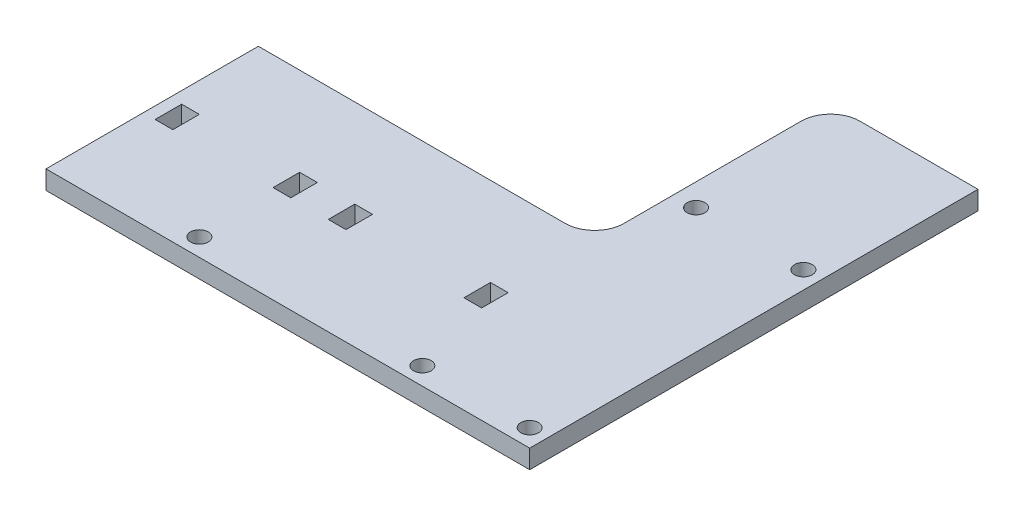
ISO-10303-21;
HEADER;
FILE_DESCRIPTION(('STEP AP214'),'2;1');
FILE_NAME('part.step','',(''),(''),'','','');
FILE_SCHEMA(('AUTOMOTIVE_DESIGN { 1 0 10303 214 1 1 1 1 }'));
ENDSEC;
DATA;
#1=APPLICATION_CONTEXT('core data for automotive mechanical design processes');
#2=APPLICATION_PROTOCOL_DEFINITION('international standard','automotive_design',2000,#1);
#3=PRODUCT_CONTEXT('',#1,'mechanical');
#4=PRODUCT('Part','Part','',(#3));
#5=PRODUCT_RELATED_PRODUCT_CATEGORY('part','',(#4));
#6=PRODUCT_DEFINITION_FORMATION('','',#4);
#7=PRODUCT_DEFINITION_CONTEXT('part definition',#1,'design');
#8=PRODUCT_DEFINITION('design','',#6,#7);
#9=PRODUCT_DEFINITION_SHAPE('','',#8);
#10=(LENGTH_UNIT() NAMED_UNIT(*) SI_UNIT(.MILLI.,.METRE.));
#11=(NAMED_UNIT(*) PLANE_ANGLE_UNIT() SI_UNIT($,.RADIAN.));
#12=(NAMED_UNIT(*) SI_UNIT($,.STERADIAN.) SOLID_ANGLE_UNIT());
#13=UNCERTAINTY_MEASURE_WITH_UNIT(LENGTH_MEASURE(1.E-05),#10,'distance_accuracy_value','');
#14=(GEOMETRIC_REPRESENTATION_CONTEXT(3) GLOBAL_UNCERTAINTY_ASSIGNED_CONTEXT((#13)) GLOBAL_UNIT_ASSIGNED_CONTEXT((#10,
#11,#12)) REPRESENTATION_CONTEXT('',''));
#15=CARTESIAN_POINT('',(0.,0.,0.));
#16=DIRECTION('',(0.,0.,1.));
#17=DIRECTION('',(1.,0.,0.));
#18=AXIS2_PLACEMENT_3D('',#15,#16,#17);
#19=CARTESIAN_POINT('',(57.,3.175,0.));
#20=DIRECTION('',(-1.,0.,0.));
#21=DIRECTION('',(0.,0.,1.));
#22=AXIS2_PLACEMENT_3D('',#19,#20,#21);
#23=PLANE('',#22);
#24=DIRECTION('',(0.,0.,-1.));
#25=VECTOR('',#24,1.);
#26=CARTESIAN_POINT('',(57.,3.175,0.));
#27=LINE('',#26,#25);
#28=CARTESIAN_POINT('',(57.,3.175,-5.));
#29=VERTEX_POINT('',#28);
#30=CARTESIAN_POINT('',(57.,3.175,-35.));
#31=VERTEX_POINT('',#30);
#32=EDGE_CURVE('E418',#29,#31,#27,.T.);
#33=ORIENTED_EDGE('',*,*,#32,.T.);
#34=DIRECTION('',(0.,-1.,0.));
#35=VECTOR('',#34,1.);
#36=CARTESIAN_POINT('',(57.,0.,-35.));
#37=LINE('',#36,#35);
#38=CARTESIAN_POINT('',(57.,0.,-35.));
#39=VERTEX_POINT('',#38);
#40=EDGE_CURVE('E472',#31,#39,#37,.T.);
#41=ORIENTED_EDGE('',*,*,#40,.T.);
#42=DIRECTION('',(0.,0.,-1.));
#43=VECTOR('',#42,1.);
#44=CARTESIAN_POINT('',(57.,0.,0.));
#45=LINE('',#44,#43);
#46=CARTESIAN_POINT('',(57.,0.,-5.));
#47=VERTEX_POINT('',#46);
#48=EDGE_CURVE('E417',#47,#39,#45,.T.);
#49=ORIENTED_EDGE('',*,*,#48,.F.);
#50=DIRECTION('',(0.,-1.,0.));
#51=VECTOR('',#50,1.);
#52=CARTESIAN_POINT('',(57.,3.175,-5.));
#53=LINE('',#52,#51);
#54=EDGE_CURVE('E470',#47,#29,#53,.F.);
#55=ORIENTED_EDGE('',*,*,#54,.T.);
#56=EDGE_LOOP('',(#33,#41,#49,#55));
#57=FACE_BOUND('',#56,.T.);
#58=ADVANCED_FACE('F39',(#57),#23,.T.);
#59=CARTESIAN_POINT('',(0.,3.175,0.));
#60=DIRECTION('',(0.,0.,-1.));
#61=DIRECTION('',(-1.,0.,0.));
#62=AXIS2_PLACEMENT_3D('',#59,#60,#61);
#63=PLANE('',#62);
#64=DIRECTION('',(1.,0.,0.));
#65=VECTOR('',#64,1.);
#66=CARTESIAN_POINT('',(0.,3.175,0.));
#67=LINE('',#66,#65);
#68=CARTESIAN_POINT('',(0.,3.175,0.));
#69=VERTEX_POINT('',#68);
#70=CARTESIAN_POINT('',(52.,3.175,0.));
#71=VERTEX_POINT('',#70);
#72=EDGE_CURVE('E423',#69,#71,#67,.T.);
#73=ORIENTED_EDGE('',*,*,#72,.T.);
#74=DIRECTION('',(0.,-1.,0.));
#75=VECTOR('',#74,1.);
#76=CARTESIAN_POINT('',(52.,0.,0.));
#77=LINE('',#76,#75);
#78=CARTESIAN_POINT('',(52.,0.,0.));
#79=VERTEX_POINT('',#78);
#80=EDGE_CURVE('E481',#71,#79,#77,.T.);
#81=ORIENTED_EDGE('',*,*,#80,.T.);
#82=DIRECTION('',(1.,0.,0.));
#83=VECTOR('',#82,1.);
#84=CARTESIAN_POINT('',(0.,0.,0.));
#85=LINE('',#84,#83);
#86=CARTESIAN_POINT('',(0.,0.,0.));
#87=VERTEX_POINT('',#86);
#88=EDGE_CURVE('E450',#87,#79,#85,.T.);
#89=ORIENTED_EDGE('',*,*,#88,.F.);
#90=DIRECTION('',(0.,-1.,0.));
#91=VECTOR('',#90,1.);
#92=CARTESIAN_POINT('',(0.,3.175,0.));
#93=LINE('',#92,#91);
#94=EDGE_CURVE('E468',#69,#87,#93,.T.);
#95=ORIENTED_EDGE('',*,*,#94,.F.);
#96=EDGE_LOOP('',(#73,#81,#89,#95));
#97=FACE_BOUND('',#96,.T.);
#98=ADVANCED_FACE('F493',(#97),#63,.T.);
#99=CARTESIAN_POINT('',(0.,3.175,0.));
#100=DIRECTION('',(1.,0.,0.));
#101=DIRECTION('',(0.,0.,-1.));
#102=AXIS2_PLACEMENT_3D('',#99,#100,#101);
#103=PLANE('',#102);
#104=DIRECTION('',(0.,0.,1.));
#105=VECTOR('',#104,1.);
#106=CARTESIAN_POINT('',(0.,0.,0.));
#107=LINE('',#106,#105);
#108=CARTESIAN_POINT('',(0.,0.,36.));
#109=VERTEX_POINT('',#108);
#110=EDGE_CURVE('E453',#87,#109,#107,.T.);
#111=ORIENTED_EDGE('',*,*,#110,.T.);
#112=DIRECTION('',(0.,-1.,0.));
#113=VECTOR('',#112,1.);
#114=CARTESIAN_POINT('',(0.,3.175,36.));
#115=LINE('',#114,#113);
#116=CARTESIAN_POINT('',(0.,3.175,36.));
#117=VERTEX_POINT('',#116);
#118=EDGE_CURVE('E465',#117,#109,#115,.T.);
#119=ORIENTED_EDGE('',*,*,#118,.F.);
#120=DIRECTION('',(0.,0.,1.));
#121=VECTOR('',#120,1.);
#122=CARTESIAN_POINT('',(0.,3.175,0.));
#123=LINE('',#122,#121);
#124=EDGE_CURVE('E433',#69,#117,#123,.T.);
#125=ORIENTED_EDGE('',*,*,#124,.F.);
#126=ORIENTED_EDGE('',*,*,#94,.T.);
#127=EDGE_LOOP('',(#111,#119,#125,#126));
#128=FACE_BOUND('',#127,.T.);
#129=ADVANCED_FACE('F551',(#128),#103,.F.);
#130=CARTESIAN_POINT('',(0.,3.175,36.));
#131=DIRECTION('',(0.,0.,-1.));
#132=DIRECTION('',(-1.,0.,0.));
#133=AXIS2_PLACEMENT_3D('',#130,#131,#132);
#134=PLANE('',#133);
#135=DIRECTION('',(1.,0.,0.));
#136=VECTOR('',#135,1.);
#137=CARTESIAN_POINT('',(0.,0.,36.));
#138=LINE('',#137,#136);
#139=CARTESIAN_POINT('',(82.,0.,36.));
#140=VERTEX_POINT('',#139);
#141=EDGE_CURVE('E455',#109,#140,#138,.T.);
#142=ORIENTED_EDGE('',*,*,#141,.T.);
#143=DIRECTION('',(0.,-1.,0.));
#144=VECTOR('',#143,1.);
#145=CARTESIAN_POINT('',(82.,3.175,36.));
#146=LINE('',#145,#144);
#147=CARTESIAN_POINT('',(82.,3.175,36.));
#148=VERTEX_POINT('',#147);
#149=EDGE_CURVE('E462',#148,#140,#146,.T.);
#150=ORIENTED_EDGE('',*,*,#149,.F.);
#151=DIRECTION('',(1.,0.,0.));
#152=VECTOR('',#151,1.);
#153=CARTESIAN_POINT('',(0.,3.175,36.));
#154=LINE('',#153,#152);
#155=EDGE_CURVE('E436',#117,#148,#154,.T.);
#156=ORIENTED_EDGE('',*,*,#155,.F.);
#157=ORIENTED_EDGE('',*,*,#118,.T.);
#158=EDGE_LOOP('',(#142,#150,#156,#157));
#159=FACE_BOUND('',#158,.T.);
#160=ADVANCED_FACE('F573',(#159),#134,.F.);
#161=CARTESIAN_POINT('',(82.,3.175,0.));
#162=DIRECTION('',(-1.,0.,0.));
#163=DIRECTION('',(0.,0.,1.));
#164=AXIS2_PLACEMENT_3D('',#161,#162,#163);
#165=PLANE('',#164);
#166=DIRECTION('',(0.,0.,-1.));
#167=VECTOR('',#166,1.);
#168=CARTESIAN_POINT('',(82.,0.,0.));
#169=LINE('',#168,#167);
#170=CARTESIAN_POINT('',(82.,0.,-40.));
#171=VERTEX_POINT('',#170);
#172=EDGE_CURVE('E457',#140,#171,#169,.T.);
#173=ORIENTED_EDGE('',*,*,#172,.T.);
#174=DIRECTION('',(0.,-1.,0.));
#175=VECTOR('',#174,1.);
#176=CARTESIAN_POINT('',(82.,3.175,-40.));
#177=LINE('',#176,#175);
#178=CARTESIAN_POINT('',(82.,3.175,-40.));
#179=VERTEX_POINT('',#178);
#180=EDGE_CURVE('E447',#179,#171,#177,.T.);
#181=ORIENTED_EDGE('',*,*,#180,.F.);
#182=DIRECTION('',(0.,0.,-1.));
#183=VECTOR('',#182,1.);
#184=CARTESIAN_POINT('',(82.,3.175,0.));
#185=LINE('',#184,#183);
#186=EDGE_CURVE('E439',#148,#179,#185,.T.);
#187=ORIENTED_EDGE('',*,*,#186,.F.);
#188=ORIENTED_EDGE('',*,*,#149,.T.);
#189=EDGE_LOOP('',(#173,#181,#187,#188));
#190=FACE_BOUND('',#189,.T.);
#191=ADVANCED_FACE('F569',(#190),#165,.F.);
#192=CARTESIAN_POINT('',(0.,3.175,-40.));
#193=DIRECTION('',(0.,0.,1.));
#194=DIRECTION('',(1.,0.,0.));
#195=AXIS2_PLACEMENT_3D('',#192,#193,#194);
#196=PLANE('',#195);
#197=DIRECTION('',(-1.,0.,0.));
#198=VECTOR('',#197,1.);
#199=CARTESIAN_POINT('',(0.,0.,-40.));
#200=LINE('',#199,#198);
#201=CARTESIAN_POINT('',(62.,0.,-40.));
#202=VERTEX_POINT('',#201);
#203=EDGE_CURVE('E424',#171,#202,#200,.T.);
#204=ORIENTED_EDGE('',*,*,#203,.T.);
#205=DIRECTION('',(0.,-1.,0.));
#206=VECTOR('',#205,1.);
#207=CARTESIAN_POINT('',(62.,3.175,-40.));
#208=LINE('',#207,#206);
#209=CARTESIAN_POINT('',(62.,3.175,-40.));
#210=VERTEX_POINT('',#209);
#211=EDGE_CURVE('E61',#202,#210,#208,.F.);
#212=ORIENTED_EDGE('',*,*,#211,.T.);
#213=DIRECTION('',(-1.,0.,0.));
#214=VECTOR('',#213,1.);
#215=CARTESIAN_POINT('',(0.,3.175,-40.));
#216=LINE('',#215,#214);
#217=EDGE_CURVE('E443',#179,#210,#216,.T.);
#218=ORIENTED_EDGE('',*,*,#217,.F.);
#219=ORIENTED_EDGE('',*,*,#180,.T.);
#220=EDGE_LOOP('',(#204,#212,#218,#219));
#221=FACE_BOUND('',#220,.T.);
#222=ADVANCED_FACE('F564',(#221),#196,.F.);
#223=CARTESIAN_POINT('',(0.,3.175,0.));
#224=DIRECTION('',(0.,1.,0.));
#225=DIRECTION('',(0.,0.,1.));
#226=AXIS2_PLACEMENT_3D('',#223,#224,#225);
#227=PLANE('',#226);
#228=DIRECTION('',(0.,0.,-1.));
#229=VECTOR('',#228,1.);
#230=CARTESIAN_POINT('',(25.,3.175,19.5000000000002));
#231=LINE('',#230,#229);
#232=CARTESIAN_POINT('',(25.,3.175,19.5000000000002));
#233=VERTEX_POINT('',#232);
#234=CARTESIAN_POINT('',(25.,3.175,15.0000000000002));
#235=VERTEX_POINT('',#234);
#236=EDGE_CURVE('E346',#233,#235,#231,.T.);
#237=ORIENTED_EDGE('',*,*,#236,.F.);
#238=DIRECTION('',(1.,0.,0.));
#239=VECTOR('',#238,1.);
#240=CARTESIAN_POINT('',(25.,3.175,19.5000000000002));
#241=LINE('',#240,#239);
#242=CARTESIAN_POINT('',(22.,3.175,19.5000000000002));
#243=VERTEX_POINT('',#242);
#244=EDGE_CURVE('E355',#243,#233,#241,.T.);
#245=ORIENTED_EDGE('',*,*,#244,.F.);
#246=DIRECTION('',(0.,0.,1.));
#247=VECTOR('',#246,1.);
#248=CARTESIAN_POINT('',(22.,3.175,19.5000000000002));
#249=LINE('',#248,#247);
#250=CARTESIAN_POINT('',(22.,3.175,15.0000000000002));
#251=VERTEX_POINT('',#250);
#252=EDGE_CURVE('E361',#251,#243,#249,.T.);
#253=ORIENTED_EDGE('',*,*,#252,.F.);
#254=DIRECTION('',(-1.,0.,0.));
#255=VECTOR('',#254,1.);
#256=CARTESIAN_POINT('',(25.,3.175,15.0000000000002));
#257=LINE('',#256,#255);
#258=EDGE_CURVE('E349',#235,#251,#257,.T.);
#259=ORIENTED_EDGE('',*,*,#258,.F.);
#260=EDGE_LOOP('',(#237,#245,#253,#259));
#261=FACE_BOUND('',#260,.T.);
#262=DIRECTION('',(0.,0.,-1.));
#263=VECTOR('',#262,1.);
#264=CARTESIAN_POINT('',(5.,3.175,19.5000000000002));
#265=LINE('',#264,#263);
#266=CARTESIAN_POINT('',(5.,3.175,19.5000000000002));
#267=VERTEX_POINT('',#266);
#268=CARTESIAN_POINT('',(5.,3.175,15.0000000000002));
#269=VERTEX_POINT('',#268);
#270=EDGE_CURVE('E308',#267,#269,#265,.T.);
#271=ORIENTED_EDGE('',*,*,#270,.F.);
#272=DIRECTION('',(1.,0.,0.));
#273=VECTOR('',#272,1.);
#274=CARTESIAN_POINT('',(5.,3.175,19.5000000000002));
#275=LINE('',#274,#273);
#276=CARTESIAN_POINT('',(2.,3.175,19.5000000000002));
#277=VERTEX_POINT('',#276);
#278=EDGE_CURVE('E320',#277,#267,#275,.T.);
#279=ORIENTED_EDGE('',*,*,#278,.F.);
#280=DIRECTION('',(0.,0.,1.));
#281=VECTOR('',#280,1.);
#282=CARTESIAN_POINT('',(2.,3.175,19.5000000000002));
#283=LINE('',#282,#281);
#284=CARTESIAN_POINT('',(2.,3.175,15.0000000000002));
#285=VERTEX_POINT('',#284);
#286=EDGE_CURVE('E326',#285,#277,#283,.T.);
#287=ORIENTED_EDGE('',*,*,#286,.F.);
#288=DIRECTION('',(-1.,0.,0.));
#289=VECTOR('',#288,1.);
#290=CARTESIAN_POINT('',(5.,3.175,15.0000000000002));
#291=LINE('',#290,#289);
#292=EDGE_CURVE('E311',#269,#285,#291,.T.);
#293=ORIENTED_EDGE('',*,*,#292,.F.);
#294=EDGE_LOOP('',(#271,#279,#287,#293));
#295=FACE_BOUND('',#294,.T.);
#296=DIRECTION('',(0.,0.,1.));
#297=VECTOR('',#296,1.);
#298=CARTESIAN_POINT('',(31.35,3.175,15.0000000000002));
#299=LINE('',#298,#297);
#300=CARTESIAN_POINT('',(31.35,3.175,15.0000000000002));
#301=VERTEX_POINT('',#300);
#302=CARTESIAN_POINT('',(31.35,3.175,19.5000000000002));
#303=VERTEX_POINT('',#302);
#304=EDGE_CURVE('E268',#301,#303,#299,.T.);
#305=ORIENTED_EDGE('',*,*,#304,.F.);
#306=DIRECTION('',(-1.,0.,0.));
#307=VECTOR('',#306,1.);
#308=CARTESIAN_POINT('',(31.35,3.175,15.0000000000002));
#309=LINE('',#308,#307);
#310=CARTESIAN_POINT('',(34.35,3.175,15.0000000000002));
#311=VERTEX_POINT('',#310);
#312=EDGE_CURVE('E280',#311,#301,#309,.T.);
#313=ORIENTED_EDGE('',*,*,#312,.F.);
#314=DIRECTION('',(0.,0.,-1.));
#315=VECTOR('',#314,1.);
#316=CARTESIAN_POINT('',(34.35,3.175,15.0000000000002));
#317=LINE('',#316,#315);
#318=CARTESIAN_POINT('',(34.35,3.175,19.5000000000002));
#319=VERTEX_POINT('',#318);
#320=EDGE_CURVE('E286',#319,#311,#317,.T.);
#321=ORIENTED_EDGE('',*,*,#320,.F.);
#322=DIRECTION('',(1.,0.,0.));
#323=VECTOR('',#322,1.);
#324=CARTESIAN_POINT('',(31.35,3.175,19.5000000000002));
#325=LINE('',#324,#323);
#326=EDGE_CURVE('E271',#303,#319,#325,.T.);
#327=ORIENTED_EDGE('',*,*,#326,.F.);
#328=EDGE_LOOP('',(#305,#313,#321,#327));
#329=FACE_BOUND('',#328,.T.);
#330=DIRECTION('',(0.,0.,1.));
#331=VECTOR('',#330,1.);
#332=CARTESIAN_POINT('',(54.35,3.175,15.));
#333=LINE('',#332,#331);
#334=CARTESIAN_POINT('',(54.35,3.175,15.));
#335=VERTEX_POINT('',#334);
#336=CARTESIAN_POINT('',(54.35,3.175,19.5));
#337=VERTEX_POINT('',#336);
#338=EDGE_CURVE('E210',#335,#337,#333,.T.);
#339=ORIENTED_EDGE('',*,*,#338,.F.);
#340=DIRECTION('',(-1.,0.,0.));
#341=VECTOR('',#340,1.);
#342=CARTESIAN_POINT('',(54.35,3.175,15.));
#343=LINE('',#342,#341);
#344=CARTESIAN_POINT('',(57.35,3.175,15.));
#345=VERTEX_POINT('',#344);
#346=EDGE_CURVE('E215',#345,#335,#343,.T.);
#347=ORIENTED_EDGE('',*,*,#346,.F.);
#348=DIRECTION('',(0.,0.,-1.));
#349=VECTOR('',#348,1.);
#350=CARTESIAN_POINT('',(57.35,3.175,15.));
#351=LINE('',#350,#349);
#352=CARTESIAN_POINT('',(57.35,3.175,19.5));
#353=VERTEX_POINT('',#352);
#354=EDGE_CURVE('E253',#353,#345,#351,.T.);
#355=ORIENTED_EDGE('',*,*,#354,.F.);
#356=DIRECTION('',(1.,0.,0.));
#357=VECTOR('',#356,1.);
#358=CARTESIAN_POINT('',(54.35,3.175,19.5));
#359=LINE('',#358,#357);
#360=EDGE_CURVE('E232',#337,#353,#359,.T.);
#361=ORIENTED_EDGE('',*,*,#360,.F.);
#362=EDGE_LOOP('',(#339,#347,#355,#361));
#363=FACE_BOUND('',#362,.T.);
#364=CARTESIAN_POINT('',(60.8,3.175,33.0000000000001));
#365=DIRECTION('',(0.,1.,0.));
#366=DIRECTION('',(0.,0.,1.));
#367=AXIS2_PLACEMENT_3D('',#364,#365,#366);
#368=CIRCLE('',#367,1.5);
#369=CARTESIAN_POINT('',(60.8,3.175,34.5000000000001));
#370=VERTEX_POINT('',#369);
#371=EDGE_CURVE('E395',#370,#370,#368,.T.);
#372=ORIENTED_EDGE('',*,*,#371,.F.);
#373=EDGE_LOOP('',(#372));
#374=FACE_BOUND('',#373,.T.);
#375=CARTESIAN_POINT('',(60.7999999999998,3.175,-13.3999999999999));
#376=DIRECTION('',(0.,1.,0.));
#377=DIRECTION('',(0.,0.,1.));
#378=AXIS2_PLACEMENT_3D('',#375,#376,#377);
#379=CIRCLE('',#378,1.5);
#380=CARTESIAN_POINT('',(60.7999999999998,3.175,-11.8999999999999));
#381=VERTEX_POINT('',#380);
#382=EDGE_CURVE('E404',#381,#381,#379,.T.);
#383=ORIENTED_EDGE('',*,*,#382,.F.);
#384=EDGE_LOOP('',(#383));
#385=FACE_BOUND('',#384,.T.);
#386=CARTESIAN_POINT('',(78.9999999999998,3.175,-13.4));
#387=DIRECTION('',(0.,1.,0.));
#388=DIRECTION('',(0.,0.,1.));
#389=AXIS2_PLACEMENT_3D('',#386,#387,#388);
#390=CIRCLE('',#389,1.5);
#391=CARTESIAN_POINT('',(78.9999999999998,3.175,-11.9));
#392=VERTEX_POINT('',#391);
#393=EDGE_CURVE('E373',#392,#392,#390,.T.);
#394=ORIENTED_EDGE('',*,*,#393,.F.);
#395=EDGE_LOOP('',(#394));
#396=FACE_BOUND('',#395,.T.);
#397=CARTESIAN_POINT('',(23.,3.175,33.0000000000001));
#398=DIRECTION('',(0.,1.,0.));
#399=DIRECTION('',(0.,0.,1.));
#400=AXIS2_PLACEMENT_3D('',#397,#398,#399);
#401=CIRCLE('',#400,1.5);
#402=CARTESIAN_POINT('',(23.,3.175,34.5000000000001));
#403=VERTEX_POINT('',#402);
#404=EDGE_CURVE('E223',#403,#403,#401,.T.);
#405=ORIENTED_EDGE('',*,*,#404,.F.);
#406=EDGE_LOOP('',(#405));
#407=FACE_BOUND('',#406,.T.);
#408=CARTESIAN_POINT('',(79.,3.175,33.));
#409=DIRECTION('',(0.,1.,0.));
#410=DIRECTION('',(0.,0.,1.));
#411=AXIS2_PLACEMENT_3D('',#408,#409,#410);
#412=CIRCLE('',#411,1.5);
#413=CARTESIAN_POINT('',(79.,3.175,34.5));
#414=VERTEX_POINT('',#413);
#415=EDGE_CURVE('E403',#414,#414,#412,.T.);
#416=ORIENTED_EDGE('',*,*,#415,.F.);
#417=EDGE_LOOP('',(#416));
#418=FACE_BOUND('',#417,.T.);
#419=ORIENTED_EDGE('',*,*,#217,.T.);
#420=CARTESIAN_POINT('',(62.,3.175,-35.));
#421=DIRECTION('',(0.,1.,0.));
#422=DIRECTION('',(0.,0.,1.));
#423=AXIS2_PLACEMENT_3D('',#420,#421,#422);
#424=CIRCLE('',#423,5.);
#425=EDGE_CURVE('E477',#210,#31,#424,.T.);
#426=ORIENTED_EDGE('',*,*,#425,.T.);
#427=ORIENTED_EDGE('',*,*,#32,.F.);
#428=CARTESIAN_POINT('',(52.,3.175,-5.));
#429=DIRECTION('',(0.,1.,0.));
#430=DIRECTION('',(0.,0.,1.));
#431=AXIS2_PLACEMENT_3D('',#428,#429,#430);
#432=CIRCLE('',#431,5.);
#433=EDGE_CURVE('E12',#29,#71,#432,.F.);
#434=ORIENTED_EDGE('',*,*,#433,.T.);
#435=ORIENTED_EDGE('',*,*,#72,.F.);
#436=ORIENTED_EDGE('',*,*,#124,.T.);
#437=ORIENTED_EDGE('',*,*,#155,.T.);
#438=ORIENTED_EDGE('',*,*,#186,.T.);
#439=EDGE_LOOP('',(#419,#426,#427,#434,#435,#436,#437,#438));
#440=FACE_BOUND('',#439,.T.);
#441=ADVANCED_FACE('F519',(#261,#295,#329,#363,#374,#385,#396,#407,#418,#440),#227,.T.);
#442=CARTESIAN_POINT('',(0.,0.,0.));
#443=DIRECTION('',(0.,1.,0.));
#444=DIRECTION('',(0.,0.,1.));
#445=AXIS2_PLACEMENT_3D('',#442,#443,#444);
#446=PLANE('',#445);
#447=DIRECTION('',(-1.,0.,0.));
#448=VECTOR('',#447,1.);
#449=CARTESIAN_POINT('',(25.,0.,19.5000000000002));
#450=LINE('',#449,#448);
#451=CARTESIAN_POINT('',(25.,0.,19.5000000000002));
#452=VERTEX_POINT('',#451);
#453=CARTESIAN_POINT('',(22.,0.,19.5000000000002));
#454=VERTEX_POINT('',#453);
#455=EDGE_CURVE('E340',#452,#454,#450,.T.);
#456=ORIENTED_EDGE('',*,*,#455,.F.);
#457=DIRECTION('',(0.,0.,1.));
#458=VECTOR('',#457,1.);
#459=CARTESIAN_POINT('',(25.,0.,19.5000000000002));
#460=LINE('',#459,#458);
#461=CARTESIAN_POINT('',(25.,0.,15.0000000000002));
#462=VERTEX_POINT('',#461);
#463=EDGE_CURVE('E343',#462,#452,#460,.T.);
#464=ORIENTED_EDGE('',*,*,#463,.F.);
#465=DIRECTION('',(1.,0.,0.));
#466=VECTOR('',#465,1.);
#467=CARTESIAN_POINT('',(25.,0.,15.0000000000002));
#468=LINE('',#467,#466);
#469=CARTESIAN_POINT('',(22.,0.,15.0000000000002));
#470=VERTEX_POINT('',#469);
#471=EDGE_CURVE('E302',#470,#462,#468,.T.);
#472=ORIENTED_EDGE('',*,*,#471,.F.);
#473=DIRECTION('',(0.,0.,-1.));
#474=VECTOR('',#473,1.);
#475=CARTESIAN_POINT('',(22.,0.,19.5000000000002));
#476=LINE('',#475,#474);
#477=EDGE_CURVE('E338',#454,#470,#476,.T.);
#478=ORIENTED_EDGE('',*,*,#477,.F.);
#479=EDGE_LOOP('',(#456,#464,#472,#478));
#480=FACE_BOUND('',#479,.T.);
#481=DIRECTION('',(-1.,0.,0.));
#482=VECTOR('',#481,1.);
#483=CARTESIAN_POINT('',(5.,0.,19.5000000000002));
#484=LINE('',#483,#482);
#485=CARTESIAN_POINT('',(5.,0.,19.5000000000002));
#486=VERTEX_POINT('',#485);
#487=CARTESIAN_POINT('',(2.,0.,19.5000000000002));
#488=VERTEX_POINT('',#487);
#489=EDGE_CURVE('E301',#486,#488,#484,.T.);
#490=ORIENTED_EDGE('',*,*,#489,.F.);
#491=DIRECTION('',(0.,0.,1.));
#492=VECTOR('',#491,1.);
#493=CARTESIAN_POINT('',(5.,0.,19.5000000000002));
#494=LINE('',#493,#492);
#495=CARTESIAN_POINT('',(5.,0.,15.0000000000002));
#496=VERTEX_POINT('',#495);
#497=EDGE_CURVE('E305',#496,#486,#494,.T.);
#498=ORIENTED_EDGE('',*,*,#497,.F.);
#499=DIRECTION('',(1.,0.,0.));
#500=VECTOR('',#499,1.);
#501=CARTESIAN_POINT('',(5.,0.,15.0000000000002));
#502=LINE('',#501,#500);
#503=CARTESIAN_POINT('',(2.,0.,15.0000000000002));
#504=VERTEX_POINT('',#503);
#505=EDGE_CURVE('E262',#504,#496,#502,.T.);
#506=ORIENTED_EDGE('',*,*,#505,.F.);
#507=DIRECTION('',(0.,0.,-1.));
#508=VECTOR('',#507,1.);
#509=CARTESIAN_POINT('',(2.,0.,19.5000000000002));
#510=LINE('',#509,#508);
#511=EDGE_CURVE('E299',#488,#504,#510,.T.);
#512=ORIENTED_EDGE('',*,*,#511,.F.);
#513=EDGE_LOOP('',(#490,#498,#506,#512));
#514=FACE_BOUND('',#513,.T.);
#515=DIRECTION('',(1.,0.,0.));
#516=VECTOR('',#515,1.);
#517=CARTESIAN_POINT('',(31.35,0.,15.0000000000002));
#518=LINE('',#517,#516);
#519=CARTESIAN_POINT('',(31.35,0.,15.0000000000002));
#520=VERTEX_POINT('',#519);
#521=CARTESIAN_POINT('',(34.35,0.,15.0000000000002));
#522=VERTEX_POINT('',#521);
#523=EDGE_CURVE('E261',#520,#522,#518,.T.);
#524=ORIENTED_EDGE('',*,*,#523,.F.);
#525=DIRECTION('',(0.,0.,-1.));
#526=VECTOR('',#525,1.);
#527=CARTESIAN_POINT('',(31.35,0.,15.0000000000002));
#528=LINE('',#527,#526);
#529=CARTESIAN_POINT('',(31.35,0.,19.5000000000002));
#530=VERTEX_POINT('',#529);
#531=EDGE_CURVE('E265',#530,#520,#528,.T.);
#532=ORIENTED_EDGE('',*,*,#531,.F.);
#533=DIRECTION('',(-1.,0.,0.));
#534=VECTOR('',#533,1.);
#535=CARTESIAN_POINT('',(31.35,0.,19.5000000000002));
#536=LINE('',#535,#534);
#537=CARTESIAN_POINT('',(34.35,0.,19.5000000000002));
#538=VERTEX_POINT('',#537);
#539=EDGE_CURVE('E290',#538,#530,#536,.T.);
#540=ORIENTED_EDGE('',*,*,#539,.F.);
#541=DIRECTION('',(0.,0.,1.));
#542=VECTOR('',#541,1.);
#543=CARTESIAN_POINT('',(34.35,0.,15.0000000000002));
#544=LINE('',#543,#542);
#545=EDGE_CURVE('E259',#522,#538,#544,.T.);
#546=ORIENTED_EDGE('',*,*,#545,.F.);
#547=EDGE_LOOP('',(#524,#532,#540,#546));
#548=FACE_BOUND('',#547,.T.);
#549=DIRECTION('',(1.,0.,0.));
#550=VECTOR('',#549,1.);
#551=CARTESIAN_POINT('',(54.35,0.,15.));
#552=LINE('',#551,#550);
#553=CARTESIAN_POINT('',(54.35,0.,15.));
#554=VERTEX_POINT('',#553);
#555=CARTESIAN_POINT('',(57.35,0.,15.));
#556=VERTEX_POINT('',#555);
#557=EDGE_CURVE('E229',#554,#556,#552,.T.);
#558=ORIENTED_EDGE('',*,*,#557,.F.);
#559=DIRECTION('',(0.,0.,-1.));
#560=VECTOR('',#559,1.);
#561=CARTESIAN_POINT('',(54.35,0.,15.));
#562=LINE('',#561,#560);
#563=CARTESIAN_POINT('',(54.35,0.,19.5));
#564=VERTEX_POINT('',#563);
#565=EDGE_CURVE('E207',#564,#554,#562,.T.);
#566=ORIENTED_EDGE('',*,*,#565,.F.);
#567=DIRECTION('',(-1.,0.,0.));
#568=VECTOR('',#567,1.);
#569=CARTESIAN_POINT('',(54.35,0.,19.5));
#570=LINE('',#569,#568);
#571=CARTESIAN_POINT('',(57.35,0.,19.5));
#572=VERTEX_POINT('',#571);
#573=EDGE_CURVE('E219',#572,#564,#570,.T.);
#574=ORIENTED_EDGE('',*,*,#573,.F.);
#575=DIRECTION('',(0.,0.,1.));
#576=VECTOR('',#575,1.);
#577=CARTESIAN_POINT('',(57.35,0.,15.));
#578=LINE('',#577,#576);
#579=EDGE_CURVE('E234',#556,#572,#578,.T.);
#580=ORIENTED_EDGE('',*,*,#579,.F.);
#581=EDGE_LOOP('',(#558,#566,#574,#580));
#582=FACE_BOUND('',#581,.T.);
#583=CARTESIAN_POINT('',(60.8,0.,33.0000000000001));
#584=DIRECTION('',(0.,1.,0.));
#585=DIRECTION('',(0.,0.,1.));
#586=AXIS2_PLACEMENT_3D('',#583,#584,#585);
#587=CIRCLE('',#586,1.5);
#588=CARTESIAN_POINT('',(60.8,0.,34.5000000000001));
#589=VERTEX_POINT('',#588);
#590=EDGE_CURVE('E400',#589,#589,#587,.F.);
#591=ORIENTED_EDGE('',*,*,#590,.F.);
#592=EDGE_LOOP('',(#591));
#593=FACE_BOUND('',#592,.T.);
#594=CARTESIAN_POINT('',(60.7999999999998,0.,-13.3999999999999));
#595=DIRECTION('',(0.,1.,0.));
#596=DIRECTION('',(0.,0.,1.));
#597=AXIS2_PLACEMENT_3D('',#594,#595,#596);
#598=CIRCLE('',#597,1.5);
#599=CARTESIAN_POINT('',(60.7999999999998,0.,-11.8999999999999));
#600=VERTEX_POINT('',#599);
#601=EDGE_CURVE('E401',#600,#600,#598,.F.);
#602=ORIENTED_EDGE('',*,*,#601,.F.);
#603=EDGE_LOOP('',(#602));
#604=FACE_BOUND('',#603,.T.);
#605=CARTESIAN_POINT('',(78.9999999999998,0.,-13.4));
#606=DIRECTION('',(0.,1.,0.));
#607=DIRECTION('',(0.,0.,1.));
#608=AXIS2_PLACEMENT_3D('',#605,#606,#607);
#609=CIRCLE('',#608,1.5);
#610=CARTESIAN_POINT('',(78.9999999999998,0.,-11.9));
#611=VERTEX_POINT('',#610);
#612=EDGE_CURVE('E378',#611,#611,#609,.F.);
#613=ORIENTED_EDGE('',*,*,#612,.F.);
#614=EDGE_LOOP('',(#613));
#615=FACE_BOUND('',#614,.T.);
#616=CARTESIAN_POINT('',(23.,0.,33.0000000000001));
#617=DIRECTION('',(0.,1.,0.));
#618=DIRECTION('',(0.,0.,1.));
#619=AXIS2_PLACEMENT_3D('',#616,#617,#618);
#620=CIRCLE('',#619,1.5);
#621=CARTESIAN_POINT('',(23.,0.,34.5000000000001));
#622=VERTEX_POINT('',#621);
#623=EDGE_CURVE('E379',#622,#622,#620,.F.);
#624=ORIENTED_EDGE('',*,*,#623,.F.);
#625=EDGE_LOOP('',(#624));
#626=FACE_BOUND('',#625,.T.);
#627=CARTESIAN_POINT('',(79.,0.,33.));
#628=DIRECTION('',(0.,1.,0.));
#629=DIRECTION('',(0.,0.,1.));
#630=AXIS2_PLACEMENT_3D('',#627,#628,#629);
#631=CIRCLE('',#630,1.5);
#632=CARTESIAN_POINT('',(79.,0.,34.5));
#633=VERTEX_POINT('',#632);
#634=EDGE_CURVE('E414',#633,#633,#631,.F.);
#635=ORIENTED_EDGE('',*,*,#634,.F.);
#636=EDGE_LOOP('',(#635));
#637=FACE_BOUND('',#636,.T.);
#638=ORIENTED_EDGE('',*,*,#48,.T.);
#639=CARTESIAN_POINT('',(62.,0.,-35.));
#640=DIRECTION('',(0.,1.,0.));
#641=DIRECTION('',(0.,0.,1.));
#642=AXIS2_PLACEMENT_3D('',#639,#640,#641);
#643=CIRCLE('',#642,5.);
#644=EDGE_CURVE('E475',#39,#202,#643,.F.);
#645=ORIENTED_EDGE('',*,*,#644,.T.);
#646=ORIENTED_EDGE('',*,*,#203,.F.);
#647=ORIENTED_EDGE('',*,*,#172,.F.);
#648=ORIENTED_EDGE('',*,*,#141,.F.);
#649=ORIENTED_EDGE('',*,*,#110,.F.);
#650=ORIENTED_EDGE('',*,*,#88,.T.);
#651=CARTESIAN_POINT('',(52.,0.,-5.));
#652=DIRECTION('',(0.,1.,0.));
#653=DIRECTION('',(0.,0.,1.));
#654=AXIS2_PLACEMENT_3D('',#651,#652,#653);
#655=CIRCLE('',#654,5.);
#656=EDGE_CURVE('E48',#79,#47,#655,.T.);
#657=ORIENTED_EDGE('',*,*,#656,.T.);
#658=EDGE_LOOP('',(#638,#645,#646,#647,#648,#649,#650,#657));
#659=FACE_BOUND('',#658,.T.);
#660=ADVANCED_FACE('F226',(#480,#514,#548,#582,#593,#604,#615,#626,#637,#659),#446,.F.);
#661=CARTESIAN_POINT('',(79.,-0.00100000000000013,33.));
#662=DIRECTION('',(0.,1.,0.));
#663=DIRECTION('',(0.,0.,1.));
#664=AXIS2_PLACEMENT_3D('',#661,#662,#663);
#665=CYLINDRICAL_SURFACE('',#664,1.5);
#666=ORIENTED_EDGE('',*,*,#415,.T.);
#667=EDGE_LOOP('',(#666));
#668=FACE_BOUND('',#667,.T.);
#669=ORIENTED_EDGE('',*,*,#634,.T.);
#670=EDGE_LOOP('',(#669));
#671=FACE_BOUND('',#670,.T.);
#672=ADVANCED_FACE('F588',(#668,#671),#665,.F.);
#673=CARTESIAN_POINT('',(23.,-0.00100000000000013,33.0000000000001));
#674=DIRECTION('',(0.,1.,0.));
#675=DIRECTION('',(0.,0.,1.));
#676=AXIS2_PLACEMENT_3D('',#673,#674,#675);
#677=CYLINDRICAL_SURFACE('',#676,1.5);
#678=ORIENTED_EDGE('',*,*,#404,.T.);
#679=EDGE_LOOP('',(#678));
#680=FACE_BOUND('',#679,.T.);
#681=ORIENTED_EDGE('',*,*,#623,.T.);
#682=EDGE_LOOP('',(#681));
#683=FACE_BOUND('',#682,.T.);
#684=ADVANCED_FACE('F593',(#680,#683),#677,.F.);
#685=CARTESIAN_POINT('',(78.9999999999998,-0.00100000000000013,-13.4));
#686=DIRECTION('',(0.,1.,0.));
#687=DIRECTION('',(0.,0.,1.));
#688=AXIS2_PLACEMENT_3D('',#685,#686,#687);
#689=CYLINDRICAL_SURFACE('',#688,1.5);
#690=ORIENTED_EDGE('',*,*,#393,.T.);
#691=EDGE_LOOP('',(#690));
#692=FACE_BOUND('',#691,.T.);
#693=ORIENTED_EDGE('',*,*,#612,.T.);
#694=EDGE_LOOP('',(#693));
#695=FACE_BOUND('',#694,.T.);
#696=ADVANCED_FACE('F599',(#692,#695),#689,.F.);
#697=CARTESIAN_POINT('',(60.7999999999998,-0.00100000000000013,-13.3999999999999));
#698=DIRECTION('',(0.,1.,0.));
#699=DIRECTION('',(0.,0.,1.));
#700=AXIS2_PLACEMENT_3D('',#697,#698,#699);
#701=CYLINDRICAL_SURFACE('',#700,1.5);
#702=ORIENTED_EDGE('',*,*,#382,.T.);
#703=EDGE_LOOP('',(#702));
#704=FACE_BOUND('',#703,.T.);
#705=ORIENTED_EDGE('',*,*,#601,.T.);
#706=EDGE_LOOP('',(#705));
#707=FACE_BOUND('',#706,.T.);
#708=ADVANCED_FACE('F595',(#704,#707),#701,.F.);
#709=CARTESIAN_POINT('',(60.8,-0.00100000000000013,33.0000000000001));
#710=DIRECTION('',(0.,1.,0.));
#711=DIRECTION('',(0.,0.,1.));
#712=AXIS2_PLACEMENT_3D('',#709,#710,#711);
#713=CYLINDRICAL_SURFACE('',#712,1.5);
#714=ORIENTED_EDGE('',*,*,#371,.T.);
#715=EDGE_LOOP('',(#714));
#716=FACE_BOUND('',#715,.T.);
#717=ORIENTED_EDGE('',*,*,#590,.T.);
#718=EDGE_LOOP('',(#717));
#719=FACE_BOUND('',#718,.T.);
#720=ADVANCED_FACE('F598',(#716,#719),#713,.F.);
#721=CARTESIAN_POINT('',(54.35,-0.00100000000000013,15.));
#722=DIRECTION('',(-1.,0.,0.));
#723=DIRECTION('',(0.,0.,1.));
#724=AXIS2_PLACEMENT_3D('',#721,#722,#723);
#725=PLANE('',#724);
#726=ORIENTED_EDGE('',*,*,#565,.T.);
#727=DIRECTION('',(0.,1.,0.));
#728=VECTOR('',#727,1.);
#729=CARTESIAN_POINT('',(54.35,-0.00100000000000013,15.));
#730=LINE('',#729,#728);
#731=EDGE_CURVE('E224',#554,#335,#730,.T.);
#732=ORIENTED_EDGE('',*,*,#731,.T.);
#733=ORIENTED_EDGE('',*,*,#338,.T.);
#734=DIRECTION('',(0.,1.,0.));
#735=VECTOR('',#734,1.);
#736=CARTESIAN_POINT('',(54.35,-0.00100000000000013,19.5));
#737=LINE('',#736,#735);
#738=EDGE_CURVE('E203',#564,#337,#737,.T.);
#739=ORIENTED_EDGE('',*,*,#738,.F.);
#740=EDGE_LOOP('',(#726,#732,#733,#739));
#741=FACE_BOUND('',#740,.T.);
#742=ADVANCED_FACE('F205',(#741),#725,.F.);
#743=CARTESIAN_POINT('',(54.35,-0.00100000000000013,15.));
#744=DIRECTION('',(0.,0.,-1.));
#745=DIRECTION('',(-1.,0.,0.));
#746=AXIS2_PLACEMENT_3D('',#743,#744,#745);
#747=PLANE('',#746);
#748=ORIENTED_EDGE('',*,*,#557,.T.);
#749=DIRECTION('',(0.,1.,0.));
#750=VECTOR('',#749,1.);
#751=CARTESIAN_POINT('',(57.35,-0.00100000000000013,15.));
#752=LINE('',#751,#750);
#753=EDGE_CURVE('E256',#556,#345,#752,.T.);
#754=ORIENTED_EDGE('',*,*,#753,.T.);
#755=ORIENTED_EDGE('',*,*,#346,.T.);
#756=ORIENTED_EDGE('',*,*,#731,.F.);
#757=EDGE_LOOP('',(#748,#754,#755,#756));
#758=FACE_BOUND('',#757,.T.);
#759=ADVANCED_FACE('F642',(#758),#747,.F.);
#760=CARTESIAN_POINT('',(57.35,-0.00100000000000013,15.));
#761=DIRECTION('',(1.,0.,0.));
#762=DIRECTION('',(0.,0.,-1.));
#763=AXIS2_PLACEMENT_3D('',#760,#761,#762);
#764=PLANE('',#763);
#765=ORIENTED_EDGE('',*,*,#579,.T.);
#766=DIRECTION('',(0.,1.,0.));
#767=VECTOR('',#766,1.);
#768=CARTESIAN_POINT('',(57.35,-0.00100000000000013,19.5));
#769=LINE('',#768,#767);
#770=EDGE_CURVE('E214',#572,#353,#769,.T.);
#771=ORIENTED_EDGE('',*,*,#770,.T.);
#772=ORIENTED_EDGE('',*,*,#354,.T.);
#773=ORIENTED_EDGE('',*,*,#753,.F.);
#774=EDGE_LOOP('',(#765,#771,#772,#773));
#775=FACE_BOUND('',#774,.T.);
#776=ADVANCED_FACE('F649',(#775),#764,.F.);
#777=CARTESIAN_POINT('',(54.35,-0.00100000000000013,19.5));
#778=DIRECTION('',(0.,0.,1.));
#779=DIRECTION('',(1.,0.,0.));
#780=AXIS2_PLACEMENT_3D('',#777,#778,#779);
#781=PLANE('',#780);
#782=ORIENTED_EDGE('',*,*,#573,.T.);
#783=ORIENTED_EDGE('',*,*,#738,.T.);
#784=ORIENTED_EDGE('',*,*,#360,.T.);
#785=ORIENTED_EDGE('',*,*,#770,.F.);
#786=EDGE_LOOP('',(#782,#783,#784,#785));
#787=FACE_BOUND('',#786,.T.);
#788=ADVANCED_FACE('F220',(#787),#781,.F.);
#789=CARTESIAN_POINT('',(31.35,-0.00100000000000013,15.0000000000002));
#790=DIRECTION('',(-1.,0.,0.));
#791=DIRECTION('',(0.,0.,1.));
#792=AXIS2_PLACEMENT_3D('',#789,#790,#791);
#793=PLANE('',#792);
#794=ORIENTED_EDGE('',*,*,#531,.T.);
#795=DIRECTION('',(0.,1.,0.));
#796=VECTOR('',#795,1.);
#797=CARTESIAN_POINT('',(31.35,-0.00100000000000013,15.0000000000002));
#798=LINE('',#797,#796);
#799=EDGE_CURVE('E288',#520,#301,#798,.T.);
#800=ORIENTED_EDGE('',*,*,#799,.T.);
#801=ORIENTED_EDGE('',*,*,#304,.T.);
#802=DIRECTION('',(0.,1.,0.));
#803=VECTOR('',#802,1.);
#804=CARTESIAN_POINT('',(31.35,-0.00100000000000013,19.5000000000002));
#805=LINE('',#804,#803);
#806=EDGE_CURVE('E285',#530,#303,#805,.T.);
#807=ORIENTED_EDGE('',*,*,#806,.F.);
#808=EDGE_LOOP('',(#794,#800,#801,#807));
#809=FACE_BOUND('',#808,.T.);
#810=ADVANCED_FACE('F664',(#809),#793,.F.);
#811=CARTESIAN_POINT('',(31.35,-0.00100000000000013,15.0000000000002));
#812=DIRECTION('',(0.,0.,-1.));
#813=DIRECTION('',(-1.,0.,0.));
#814=AXIS2_PLACEMENT_3D('',#811,#812,#813);
#815=PLANE('',#814);
#816=ORIENTED_EDGE('',*,*,#523,.T.);
#817=DIRECTION('',(0.,1.,0.));
#818=VECTOR('',#817,1.);
#819=CARTESIAN_POINT('',(34.35,-0.00100000000000013,15.0000000000002));
#820=LINE('',#819,#818);
#821=EDGE_CURVE('E291',#522,#311,#820,.T.);
#822=ORIENTED_EDGE('',*,*,#821,.T.);
#823=ORIENTED_EDGE('',*,*,#312,.T.);
#824=ORIENTED_EDGE('',*,*,#799,.F.);
#825=EDGE_LOOP('',(#816,#822,#823,#824));
#826=FACE_BOUND('',#825,.T.);
#827=ADVANCED_FACE('F671',(#826),#815,.F.);
#828=CARTESIAN_POINT('',(34.35,-0.00100000000000013,15.0000000000002));
#829=DIRECTION('',(1.,0.,0.));
#830=DIRECTION('',(0.,0.,-1.));
#831=AXIS2_PLACEMENT_3D('',#828,#829,#830);
#832=PLANE('',#831);
#833=ORIENTED_EDGE('',*,*,#545,.T.);
#834=DIRECTION('',(0.,1.,0.));
#835=VECTOR('',#834,1.);
#836=CARTESIAN_POINT('',(34.35,-0.00100000000000013,19.5000000000002));
#837=LINE('',#836,#835);
#838=EDGE_CURVE('E293',#538,#319,#837,.T.);
#839=ORIENTED_EDGE('',*,*,#838,.T.);
#840=ORIENTED_EDGE('',*,*,#320,.T.);
#841=ORIENTED_EDGE('',*,*,#821,.F.);
#842=EDGE_LOOP('',(#833,#839,#840,#841));
#843=FACE_BOUND('',#842,.T.);
#844=ADVANCED_FACE('F679',(#843),#832,.F.);
#845=CARTESIAN_POINT('',(31.35,-0.00100000000000013,19.5000000000002));
#846=DIRECTION('',(0.,0.,1.));
#847=DIRECTION('',(1.,0.,0.));
#848=AXIS2_PLACEMENT_3D('',#845,#846,#847);
#849=PLANE('',#848);
#850=ORIENTED_EDGE('',*,*,#539,.T.);
#851=ORIENTED_EDGE('',*,*,#806,.T.);
#852=ORIENTED_EDGE('',*,*,#326,.T.);
#853=ORIENTED_EDGE('',*,*,#838,.F.);
#854=EDGE_LOOP('',(#850,#851,#852,#853));
#855=FACE_BOUND('',#854,.T.);
#856=ADVANCED_FACE('F687',(#855),#849,.F.);
#857=CARTESIAN_POINT('',(5.,-0.00100000000000013,19.5000000000002));
#858=DIRECTION('',(1.,0.,0.));
#859=DIRECTION('',(0.,0.,-1.));
#860=AXIS2_PLACEMENT_3D('',#857,#858,#859);
#861=PLANE('',#860);
#862=ORIENTED_EDGE('',*,*,#497,.T.);
#863=DIRECTION('',(0.,1.,0.));
#864=VECTOR('',#863,1.);
#865=CARTESIAN_POINT('',(5.,-0.00100000000000013,19.5000000000002));
#866=LINE('',#865,#864);
#867=EDGE_CURVE('E328',#486,#267,#866,.T.);
#868=ORIENTED_EDGE('',*,*,#867,.T.);
#869=ORIENTED_EDGE('',*,*,#270,.T.);
#870=DIRECTION('',(0.,1.,0.));
#871=VECTOR('',#870,1.);
#872=CARTESIAN_POINT('',(5.,-0.00100000000000013,15.0000000000002));
#873=LINE('',#872,#871);
#874=EDGE_CURVE('E325',#496,#269,#873,.T.);
#875=ORIENTED_EDGE('',*,*,#874,.F.);
#876=EDGE_LOOP('',(#862,#868,#869,#875));
#877=FACE_BOUND('',#876,.T.);
#878=ADVANCED_FACE('F695',(#877),#861,.F.);
#879=CARTESIAN_POINT('',(5.,-0.00100000000000013,19.5000000000002));
#880=DIRECTION('',(0.,0.,1.));
#881=DIRECTION('',(1.,0.,0.));
#882=AXIS2_PLACEMENT_3D('',#879,#880,#881);
#883=PLANE('',#882);
#884=ORIENTED_EDGE('',*,*,#489,.T.);
#885=DIRECTION('',(0.,1.,0.));
#886=VECTOR('',#885,1.);
#887=CARTESIAN_POINT('',(2.,-0.00100000000000013,19.5000000000002));
#888=LINE('',#887,#886);
#889=EDGE_CURVE('E330',#488,#277,#888,.T.);
#890=ORIENTED_EDGE('',*,*,#889,.T.);
#891=ORIENTED_EDGE('',*,*,#278,.T.);
#892=ORIENTED_EDGE('',*,*,#867,.F.);
#893=EDGE_LOOP('',(#884,#890,#891,#892));
#894=FACE_BOUND('',#893,.T.);
#895=ADVANCED_FACE('F703',(#894),#883,.F.);
#896=CARTESIAN_POINT('',(2.,-0.00100000000000013,19.5000000000002));
#897=DIRECTION('',(-1.,0.,0.));
#898=DIRECTION('',(0.,0.,1.));
#899=AXIS2_PLACEMENT_3D('',#896,#897,#898);
#900=PLANE('',#899);
#901=ORIENTED_EDGE('',*,*,#511,.T.);
#902=DIRECTION('',(0.,1.,0.));
#903=VECTOR('',#902,1.);
#904=CARTESIAN_POINT('',(2.,-0.00100000000000013,15.0000000000002));
#905=LINE('',#904,#903);
#906=EDGE_CURVE('E332',#504,#285,#905,.T.);
#907=ORIENTED_EDGE('',*,*,#906,.T.);
#908=ORIENTED_EDGE('',*,*,#286,.T.);
#909=ORIENTED_EDGE('',*,*,#889,.F.);
#910=EDGE_LOOP('',(#901,#907,#908,#909));
#911=FACE_BOUND('',#910,.T.);
#912=ADVANCED_FACE('F541',(#911),#900,.F.);
#913=CARTESIAN_POINT('',(5.,-0.00100000000000013,15.0000000000002));
#914=DIRECTION('',(0.,0.,-1.));
#915=DIRECTION('',(-1.,0.,0.));
#916=AXIS2_PLACEMENT_3D('',#913,#914,#915);
#917=PLANE('',#916);
#918=ORIENTED_EDGE('',*,*,#505,.T.);
#919=ORIENTED_EDGE('',*,*,#874,.T.);
#920=ORIENTED_EDGE('',*,*,#292,.T.);
#921=ORIENTED_EDGE('',*,*,#906,.F.);
#922=EDGE_LOOP('',(#918,#919,#920,#921));
#923=FACE_BOUND('',#922,.T.);
#924=ADVANCED_FACE('F534',(#923),#917,.F.);
#925=CARTESIAN_POINT('',(25.,-0.00100000000000013,19.5000000000002));
#926=DIRECTION('',(1.,0.,0.));
#927=DIRECTION('',(0.,0.,-1.));
#928=AXIS2_PLACEMENT_3D('',#925,#926,#927);
#929=PLANE('',#928);
#930=ORIENTED_EDGE('',*,*,#463,.T.);
#931=DIRECTION('',(0.,1.,0.));
#932=VECTOR('',#931,1.);
#933=CARTESIAN_POINT('',(25.,-0.00100000000000013,19.5000000000002));
#934=LINE('',#933,#932);
#935=EDGE_CURVE('E363',#452,#233,#934,.T.);
#936=ORIENTED_EDGE('',*,*,#935,.T.);
#937=ORIENTED_EDGE('',*,*,#236,.T.);
#938=DIRECTION('',(0.,1.,0.));
#939=VECTOR('',#938,1.);
#940=CARTESIAN_POINT('',(25.,-0.00100000000000013,15.0000000000002));
#941=LINE('',#940,#939);
#942=EDGE_CURVE('E360',#462,#235,#941,.T.);
#943=ORIENTED_EDGE('',*,*,#942,.F.);
#944=EDGE_LOOP('',(#930,#936,#937,#943));
#945=FACE_BOUND('',#944,.T.);
#946=ADVANCED_FACE('F532',(#945),#929,.F.);
#947=CARTESIAN_POINT('',(25.,-0.00100000000000013,19.5000000000002));
#948=DIRECTION('',(0.,0.,1.));
#949=DIRECTION('',(1.,0.,0.));
#950=AXIS2_PLACEMENT_3D('',#947,#948,#949);
#951=PLANE('',#950);
#952=ORIENTED_EDGE('',*,*,#455,.T.);
#953=DIRECTION('',(0.,1.,0.));
#954=VECTOR('',#953,1.);
#955=CARTESIAN_POINT('',(22.,-0.00100000000000013,19.5000000000002));
#956=LINE('',#955,#954);
#957=EDGE_CURVE('E365',#454,#243,#956,.T.);
#958=ORIENTED_EDGE('',*,*,#957,.T.);
#959=ORIENTED_EDGE('',*,*,#244,.T.);
#960=ORIENTED_EDGE('',*,*,#935,.F.);
#961=EDGE_LOOP('',(#952,#958,#959,#960));
#962=FACE_BOUND('',#961,.T.);
#963=ADVANCED_FACE('F522',(#962),#951,.F.);
#964=CARTESIAN_POINT('',(22.,-0.00100000000000013,19.5000000000002));
#965=DIRECTION('',(-1.,0.,0.));
#966=DIRECTION('',(0.,0.,1.));
#967=AXIS2_PLACEMENT_3D('',#964,#965,#966);
#968=PLANE('',#967);
#969=ORIENTED_EDGE('',*,*,#477,.T.);
#970=DIRECTION('',(0.,1.,0.));
#971=VECTOR('',#970,1.);
#972=CARTESIAN_POINT('',(22.,-0.00100000000000013,15.0000000000002));
#973=LINE('',#972,#971);
#974=EDGE_CURVE('E367',#470,#251,#973,.T.);
#975=ORIENTED_EDGE('',*,*,#974,.T.);
#976=ORIENTED_EDGE('',*,*,#252,.T.);
#977=ORIENTED_EDGE('',*,*,#957,.F.);
#978=EDGE_LOOP('',(#969,#975,#976,#977));
#979=FACE_BOUND('',#978,.T.);
#980=ADVANCED_FACE('F514',(#979),#968,.F.);
#981=CARTESIAN_POINT('',(25.,-0.00100000000000013,15.0000000000002));
#982=DIRECTION('',(0.,0.,-1.));
#983=DIRECTION('',(-1.,0.,0.));
#984=AXIS2_PLACEMENT_3D('',#981,#982,#983);
#985=PLANE('',#984);
#986=ORIENTED_EDGE('',*,*,#471,.T.);
#987=ORIENTED_EDGE('',*,*,#942,.T.);
#988=ORIENTED_EDGE('',*,*,#258,.T.);
#989=ORIENTED_EDGE('',*,*,#974,.F.);
#990=EDGE_LOOP('',(#986,#987,#988,#989));
#991=FACE_BOUND('',#990,.T.);
#992=ADVANCED_FACE('F530',(#991),#985,.F.);
#993=CARTESIAN_POINT('',(62.,3.175,-35.));
#994=DIRECTION('',(0.,1.,0.));
#995=DIRECTION('',(0.,0.,1.));
#996=AXIS2_PLACEMENT_3D('',#993,#994,#995);
#997=CYLINDRICAL_SURFACE('',#996,5.);
#998=ORIENTED_EDGE('',*,*,#425,.F.);
#999=ORIENTED_EDGE('',*,*,#211,.F.);
#1000=ORIENTED_EDGE('',*,*,#644,.F.);
#1001=ORIENTED_EDGE('',*,*,#40,.F.);
#1002=EDGE_LOOP('',(#998,#999,#1000,#1001));
#1003=FACE_BOUND('',#1002,.T.);
#1004=ADVANCED_FACE('F554',(#1003),#997,.T.);
#1005=CARTESIAN_POINT('',(52.,3.175,-5.));
#1006=DIRECTION('',(0.,1.,0.));
#1007=DIRECTION('',(0.,0.,1.));
#1008=AXIS2_PLACEMENT_3D('',#1005,#1006,#1007);
#1009=CYLINDRICAL_SURFACE('',#1008,5.);
#1010=ORIENTED_EDGE('',*,*,#433,.F.);
#1011=ORIENTED_EDGE('',*,*,#54,.F.);
#1012=ORIENTED_EDGE('',*,*,#656,.F.);
#1013=ORIENTED_EDGE('',*,*,#80,.F.);
#1014=EDGE_LOOP('',(#1010,#1011,#1012,#1013));
#1015=FACE_BOUND('',#1014,.T.);
#1016=ADVANCED_FACE('F41',(#1015),#1009,.F.);
#1017=CLOSED_SHELL('',(#58,#98,#129,#160,#191,#222,#441,#660,#672,#684,#696,#708,#720,#742,#759,
#776,#788,#810,#827,#844,#856,#878,#895,#912,#924,#946,#963,#980,#992,#1004,#1016));
#1018=MANIFOLD_SOLID_BREP('B2',#1017);
#1019=ADVANCED_BREP_SHAPE_REPRESENTATION('',(#18,#1018),#14);
#1020=SHAPE_DEFINITION_REPRESENTATION(#9,#1019);
ENDSEC;
END-ISO-10303-21;
